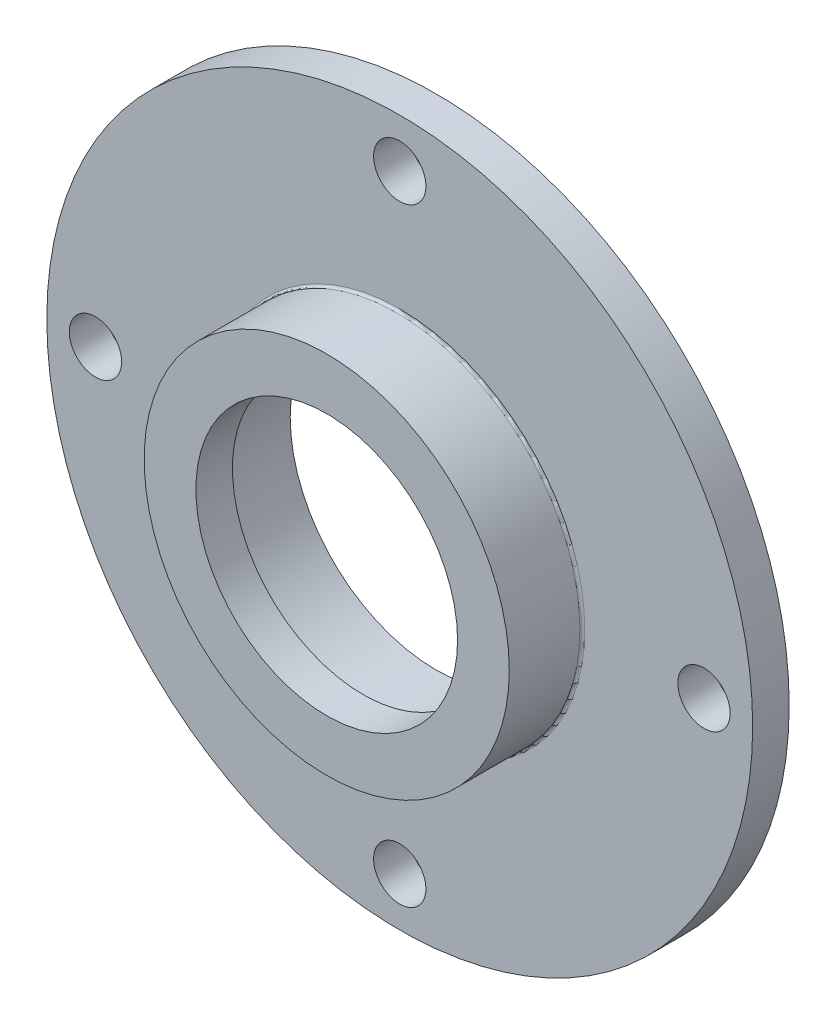
ISO-10303-21;
HEADER;
FILE_DESCRIPTION(('STEP AP214'),'2;1');
FILE_NAME('part.step','',(''),(''),'','','');
FILE_SCHEMA(('AUTOMOTIVE_DESIGN { 1 0 10303 214 1 1 1 1 }'));
ENDSEC;
DATA;
#1=APPLICATION_CONTEXT('core data for automotive mechanical design processes');
#2=APPLICATION_PROTOCOL_DEFINITION('international standard','automotive_design',2000,#1);
#3=PRODUCT_CONTEXT('',#1,'mechanical');
#4=PRODUCT('Part','Part','',(#3));
#5=PRODUCT_RELATED_PRODUCT_CATEGORY('part','',(#4));
#6=PRODUCT_DEFINITION_FORMATION('','',#4);
#7=PRODUCT_DEFINITION_CONTEXT('part definition',#1,'design');
#8=PRODUCT_DEFINITION('design','',#6,#7);
#9=PRODUCT_DEFINITION_SHAPE('','',#8);
#10=(LENGTH_UNIT() NAMED_UNIT(*) SI_UNIT(.MILLI.,.METRE.));
#11=(NAMED_UNIT(*) PLANE_ANGLE_UNIT() SI_UNIT($,.RADIAN.));
#12=(NAMED_UNIT(*) SI_UNIT($,.STERADIAN.) SOLID_ANGLE_UNIT());
#13=UNCERTAINTY_MEASURE_WITH_UNIT(LENGTH_MEASURE(1.E-05),#10,'distance_accuracy_value','');
#14=(GEOMETRIC_REPRESENTATION_CONTEXT(3) GLOBAL_UNCERTAINTY_ASSIGNED_CONTEXT((#13)) GLOBAL_UNIT_ASSIGNED_CONTEXT((#10,
#11,#12)) REPRESENTATION_CONTEXT('',''));
#15=CARTESIAN_POINT('',(0.,0.,0.));
#16=DIRECTION('',(0.,0.,1.));
#17=DIRECTION('',(1.,0.,0.));
#18=AXIS2_PLACEMENT_3D('',#15,#16,#17);
#19=CARTESIAN_POINT('',(0.,0.,3.));
#20=DIRECTION('',(0.,0.,-1.));
#21=DIRECTION('',(-1.,0.,0.));
#22=AXIS2_PLACEMENT_3D('',#19,#20,#21);
#23=CYLINDRICAL_SURFACE('',#22,12.);
#24=CARTESIAN_POINT('',(0.,0.,5.8));
#25=DIRECTION('',(0.,0.,1.));
#26=DIRECTION('',(1.,0.,0.));
#27=AXIS2_PLACEMENT_3D('',#24,#25,#26);
#28=CIRCLE('',#27,12.);
#29=CARTESIAN_POINT('',(12.,0.,5.8));
#30=VERTEX_POINT('',#29);
#31=EDGE_CURVE('E48',#30,#30,#28,.T.);
#32=ORIENTED_EDGE('',*,*,#31,.T.);
#33=EDGE_LOOP('',(#32));
#34=FACE_BOUND('',#33,.T.);
#35=CARTESIAN_POINT('',(0.,0.,0.));
#36=DIRECTION('',(0.,0.,1.));
#37=DIRECTION('',(1.,0.,0.));
#38=AXIS2_PLACEMENT_3D('',#35,#36,#37);
#39=CIRCLE('',#38,12.);
#40=CARTESIAN_POINT('',(12.,0.,0.));
#41=VERTEX_POINT('',#40);
#42=EDGE_CURVE('E57',#41,#41,#39,.T.);
#43=ORIENTED_EDGE('',*,*,#42,.F.);
#44=EDGE_LOOP('',(#43));
#45=FACE_BOUND('',#44,.T.);
#46=ADVANCED_FACE('F33',(#34,#45),#23,.F.);
#47=CARTESIAN_POINT('',(0.,0.,3.));
#48=DIRECTION('',(0.,0.,1.));
#49=DIRECTION('',(1.,0.,0.));
#50=AXIS2_PLACEMENT_3D('',#47,#48,#49);
#51=PLANE('',#50);
#52=CARTESIAN_POINT('',(0.,0.,3.));
#53=DIRECTION('',(0.,0.,1.));
#54=DIRECTION('',(1.,0.,0.));
#55=AXIS2_PLACEMENT_3D('',#52,#53,#54);
#56=CIRCLE('',#55,15.2);
#57=CARTESIAN_POINT('',(15.2,0.,3.));
#58=VERTEX_POINT('',#57);
#59=EDGE_CURVE('E10',#58,#58,#56,.F.);
#60=ORIENTED_EDGE('',*,*,#59,.T.);
#61=EDGE_LOOP('',(#60));
#62=FACE_BOUND('',#61,.T.);
#63=CARTESIAN_POINT('',(0.,25.,3.));
#64=DIRECTION('',(0.,0.,1.));
#65=DIRECTION('',(1.,0.,0.));
#66=AXIS2_PLACEMENT_3D('',#63,#64,#65);
#67=CIRCLE('',#66,2.15);
#68=CARTESIAN_POINT('',(2.15,25.,3.));
#69=VERTEX_POINT('',#68);
#70=EDGE_CURVE('E92',#69,#69,#67,.T.);
#71=ORIENTED_EDGE('',*,*,#70,.F.);
#72=EDGE_LOOP('',(#71));
#73=FACE_BOUND('',#72,.T.);
#74=CARTESIAN_POINT('',(25.0000000000006,5.52172050504306E-13,3.));
#75=DIRECTION('',(0.,0.,1.));
#76=DIRECTION('',(1.,0.,0.));
#77=AXIS2_PLACEMENT_3D('',#74,#75,#76);
#78=CIRCLE('',#77,2.15);
#79=CARTESIAN_POINT('',(27.1500000000006,5.52172050504306E-13,3.));
#80=VERTEX_POINT('',#79);
#81=EDGE_CURVE('E86',#80,#80,#78,.T.);
#82=ORIENTED_EDGE('',*,*,#81,.F.);
#83=EDGE_LOOP('',(#82));
#84=FACE_BOUND('',#83,.T.);
#85=CARTESIAN_POINT('',(1.10434410100861E-12,-25.,3.));
#86=DIRECTION('',(0.,0.,1.));
#87=DIRECTION('',(1.,0.,0.));
#88=AXIS2_PLACEMENT_3D('',#85,#86,#87);
#89=CIRCLE('',#88,2.15);
#90=CARTESIAN_POINT('',(2.1500000000011,-25.,3.));
#91=VERTEX_POINT('',#90);
#92=EDGE_CURVE('E80',#91,#91,#89,.T.);
#93=ORIENTED_EDGE('',*,*,#92,.F.);
#94=EDGE_LOOP('',(#93));
#95=FACE_BOUND('',#94,.T.);
#96=CARTESIAN_POINT('',(-24.9999999999995,-5.49110433506438E-13,3.));
#97=DIRECTION('',(0.,0.,1.));
#98=DIRECTION('',(1.,0.,0.));
#99=AXIS2_PLACEMENT_3D('',#96,#97,#98);
#100=CIRCLE('',#99,2.15);
#101=CARTESIAN_POINT('',(-22.8499999999995,-5.49110433506438E-13,3.));
#102=VERTEX_POINT('',#101);
#103=EDGE_CURVE('E74',#102,#102,#100,.T.);
#104=ORIENTED_EDGE('',*,*,#103,.F.);
#105=EDGE_LOOP('',(#104));
#106=FACE_BOUND('',#105,.T.);
#107=CARTESIAN_POINT('',(0.,0.,3.));
#108=DIRECTION('',(0.,0.,1.));
#109=DIRECTION('',(1.,0.,0.));
#110=AXIS2_PLACEMENT_3D('',#107,#108,#109);
#111=CIRCLE('',#110,29.);
#112=CARTESIAN_POINT('',(29.,0.,3.));
#113=VERTEX_POINT('',#112);
#114=EDGE_CURVE('E53',#113,#113,#111,.T.);
#115=ORIENTED_EDGE('',*,*,#114,.T.);
#116=EDGE_LOOP('',(#115));
#117=FACE_BOUND('',#116,.T.);
#118=ADVANCED_FACE('F98',(#62,#73,#84,#95,#106,#117),#51,.T.);
#119=CARTESIAN_POINT('',(0.,0.,0.));
#120=DIRECTION('',(0.,0.,1.));
#121=DIRECTION('',(1.,0.,0.));
#122=AXIS2_PLACEMENT_3D('',#119,#120,#121);
#123=PLANE('',#122);
#124=CARTESIAN_POINT('',(0.,25.,0.));
#125=DIRECTION('',(0.,0.,1.));
#126=DIRECTION('',(1.,0.,0.));
#127=AXIS2_PLACEMENT_3D('',#124,#125,#126);
#128=CIRCLE('',#127,2.15);
#129=CARTESIAN_POINT('',(2.15,25.,0.));
#130=VERTEX_POINT('',#129);
#131=EDGE_CURVE('E89',#130,#130,#128,.T.);
#132=ORIENTED_EDGE('',*,*,#131,.T.);
#133=EDGE_LOOP('',(#132));
#134=FACE_BOUND('',#133,.T.);
#135=CARTESIAN_POINT('',(25.0000000000006,5.52172050504306E-13,0.));
#136=DIRECTION('',(0.,0.,1.));
#137=DIRECTION('',(1.,0.,0.));
#138=AXIS2_PLACEMENT_3D('',#135,#136,#137);
#139=CIRCLE('',#138,2.15);
#140=CARTESIAN_POINT('',(27.1500000000006,5.52172050504306E-13,0.));
#141=VERTEX_POINT('',#140);
#142=EDGE_CURVE('E83',#141,#141,#139,.T.);
#143=ORIENTED_EDGE('',*,*,#142,.T.);
#144=EDGE_LOOP('',(#143));
#145=FACE_BOUND('',#144,.T.);
#146=CARTESIAN_POINT('',(1.10434410100861E-12,-25.,0.));
#147=DIRECTION('',(0.,0.,1.));
#148=DIRECTION('',(1.,0.,0.));
#149=AXIS2_PLACEMENT_3D('',#146,#147,#148);
#150=CIRCLE('',#149,2.15);
#151=CARTESIAN_POINT('',(2.1500000000011,-25.,0.));
#152=VERTEX_POINT('',#151);
#153=EDGE_CURVE('E77',#152,#152,#150,.T.);
#154=ORIENTED_EDGE('',*,*,#153,.T.);
#155=EDGE_LOOP('',(#154));
#156=FACE_BOUND('',#155,.T.);
#157=CARTESIAN_POINT('',(-24.9999999999995,-5.49110433506438E-13,0.));
#158=DIRECTION('',(0.,0.,1.));
#159=DIRECTION('',(1.,0.,0.));
#160=AXIS2_PLACEMENT_3D('',#157,#158,#159);
#161=CIRCLE('',#160,2.15);
#162=CARTESIAN_POINT('',(-22.8499999999995,-5.49110433506438E-13,0.));
#163=VERTEX_POINT('',#162);
#164=EDGE_CURVE('E69',#163,#163,#161,.T.);
#165=ORIENTED_EDGE('',*,*,#164,.T.);
#166=EDGE_LOOP('',(#165));
#167=FACE_BOUND('',#166,.T.);
#168=CARTESIAN_POINT('',(0.,0.,0.));
#169=DIRECTION('',(0.,0.,1.));
#170=DIRECTION('',(1.,0.,0.));
#171=AXIS2_PLACEMENT_3D('',#168,#169,#170);
#172=CIRCLE('',#171,29.);
#173=CARTESIAN_POINT('',(29.,0.,0.));
#174=VERTEX_POINT('',#173);
#175=EDGE_CURVE('E54',#174,#174,#172,.T.);
#176=ORIENTED_EDGE('',*,*,#175,.F.);
#177=EDGE_LOOP('',(#176));
#178=FACE_BOUND('',#177,.T.);
#179=ORIENTED_EDGE('',*,*,#42,.T.);
#180=EDGE_LOOP('',(#179));
#181=FACE_BOUND('',#180,.T.);
#182=ADVANCED_FACE('F101',(#134,#145,#156,#167,#178,#181),#123,.F.);
#183=CARTESIAN_POINT('',(0.,0.,3.));
#184=DIRECTION('',(0.,0.,-1.));
#185=DIRECTION('',(-1.,0.,0.));
#186=AXIS2_PLACEMENT_3D('',#183,#184,#185);
#187=CYLINDRICAL_SURFACE('',#186,29.);
#188=ORIENTED_EDGE('',*,*,#114,.F.);
#189=EDGE_LOOP('',(#188));
#190=FACE_BOUND('',#189,.T.);
#191=ORIENTED_EDGE('',*,*,#175,.T.);
#192=EDGE_LOOP('',(#191));
#193=FACE_BOUND('',#192,.T.);
#194=ADVANCED_FACE('F111',(#190,#193),#187,.T.);
#195=CARTESIAN_POINT('',(0.,0.,9.));
#196=DIRECTION('',(0.,0.,1.));
#197=DIRECTION('',(1.,0.,0.));
#198=AXIS2_PLACEMENT_3D('',#195,#196,#197);
#199=PLANE('',#198);
#200=CARTESIAN_POINT('',(0.,0.,9.));
#201=DIRECTION('',(0.,0.,1.));
#202=DIRECTION('',(1.,0.,0.));
#203=AXIS2_PLACEMENT_3D('',#200,#201,#202);
#204=CIRCLE('',#203,15.);
#205=CARTESIAN_POINT('',(15.,0.,9.));
#206=VERTEX_POINT('',#205);
#207=EDGE_CURVE('E62',#206,#206,#204,.T.);
#208=ORIENTED_EDGE('',*,*,#207,.T.);
#209=EDGE_LOOP('',(#208));
#210=FACE_BOUND('',#209,.T.);
#211=CARTESIAN_POINT('',(0.,0.,9.));
#212=DIRECTION('',(0.,0.,1.));
#213=DIRECTION('',(1.,0.,0.));
#214=AXIS2_PLACEMENT_3D('',#211,#212,#213);
#215=CIRCLE('',#214,10.75);
#216=CARTESIAN_POINT('',(10.75,0.,9.));
#217=VERTEX_POINT('',#216);
#218=EDGE_CURVE('E66',#217,#217,#215,.T.);
#219=ORIENTED_EDGE('',*,*,#218,.F.);
#220=EDGE_LOOP('',(#219));
#221=FACE_BOUND('',#220,.T.);
#222=ADVANCED_FACE('F114',(#210,#221),#199,.T.);
#223=CARTESIAN_POINT('',(0.,0.,9.));
#224=DIRECTION('',(0.,0.,-1.));
#225=DIRECTION('',(-1.,0.,0.));
#226=AXIS2_PLACEMENT_3D('',#223,#224,#225);
#227=CYLINDRICAL_SURFACE('',#226,15.);
#228=CARTESIAN_POINT('',(0.,0.,3.2));
#229=DIRECTION('',(0.,0.,1.));
#230=DIRECTION('',(1.,0.,0.));
#231=AXIS2_PLACEMENT_3D('',#228,#229,#230);
#232=CIRCLE('',#231,15.);
#233=CARTESIAN_POINT('',(15.,0.,3.2));
#234=VERTEX_POINT('',#233);
#235=EDGE_CURVE('E40',#234,#234,#232,.T.);
#236=ORIENTED_EDGE('',*,*,#235,.T.);
#237=EDGE_LOOP('',(#236));
#238=FACE_BOUND('',#237,.T.);
#239=ORIENTED_EDGE('',*,*,#207,.F.);
#240=EDGE_LOOP('',(#239));
#241=FACE_BOUND('',#240,.T.);
#242=ADVANCED_FACE('F130',(#238,#241),#227,.T.);
#243=CARTESIAN_POINT('',(0.,0.,6.));
#244=DIRECTION('',(0.,0.,1.));
#245=DIRECTION('',(1.,0.,0.));
#246=AXIS2_PLACEMENT_3D('',#243,#244,#245);
#247=PLANE('',#246);
#248=CARTESIAN_POINT('',(0.,0.,6.));
#249=DIRECTION('',(0.,0.,1.));
#250=DIRECTION('',(1.,0.,0.));
#251=AXIS2_PLACEMENT_3D('',#248,#249,#250);
#252=CIRCLE('',#251,11.8);
#253=CARTESIAN_POINT('',(11.8,0.,6.));
#254=VERTEX_POINT('',#253);
#255=EDGE_CURVE('E44',#254,#254,#252,.F.);
#256=ORIENTED_EDGE('',*,*,#255,.T.);
#257=EDGE_LOOP('',(#256));
#258=FACE_BOUND('',#257,.T.);
#259=CARTESIAN_POINT('',(0.,0.,6.));
#260=DIRECTION('',(0.,0.,1.));
#261=DIRECTION('',(1.,0.,0.));
#262=AXIS2_PLACEMENT_3D('',#259,#260,#261);
#263=CIRCLE('',#262,10.75);
#264=CARTESIAN_POINT('',(10.75,0.,6.));
#265=VERTEX_POINT('',#264);
#266=EDGE_CURVE('E65',#265,#265,#263,.T.);
#267=ORIENTED_EDGE('',*,*,#266,.T.);
#268=EDGE_LOOP('',(#267));
#269=FACE_BOUND('',#268,.T.);
#270=ADVANCED_FACE('F147',(#258,#269),#247,.F.);
#271=CARTESIAN_POINT('',(0.,0.,6.));
#272=DIRECTION('',(0.,0.,1.));
#273=DIRECTION('',(1.,0.,0.));
#274=AXIS2_PLACEMENT_3D('',#271,#272,#273);
#275=CYLINDRICAL_SURFACE('',#274,10.75);
#276=ORIENTED_EDGE('',*,*,#266,.F.);
#277=EDGE_LOOP('',(#276));
#278=FACE_BOUND('',#277,.T.);
#279=ORIENTED_EDGE('',*,*,#218,.T.);
#280=EDGE_LOOP('',(#279));
#281=FACE_BOUND('',#280,.T.);
#282=ADVANCED_FACE('F150',(#278,#281),#275,.F.);
#283=CARTESIAN_POINT('',(-24.9999999999995,-5.49110433506438E-13,3.));
#284=DIRECTION('',(0.,0.,1.));
#285=DIRECTION('',(1.,0.,0.));
#286=AXIS2_PLACEMENT_3D('',#283,#284,#285);
#287=CYLINDRICAL_SURFACE('',#286,2.15);
#288=ORIENTED_EDGE('',*,*,#164,.F.);
#289=EDGE_LOOP('',(#288));
#290=FACE_BOUND('',#289,.T.);
#291=ORIENTED_EDGE('',*,*,#103,.T.);
#292=EDGE_LOOP('',(#291));
#293=FACE_BOUND('',#292,.T.);
#294=ADVANCED_FACE('F156',(#290,#293),#287,.F.);
#295=CARTESIAN_POINT('',(1.10434410100861E-12,-25.,3.));
#296=DIRECTION('',(0.,0.,1.));
#297=DIRECTION('',(1.,0.,0.));
#298=AXIS2_PLACEMENT_3D('',#295,#296,#297);
#299=CYLINDRICAL_SURFACE('',#298,2.15);
#300=ORIENTED_EDGE('',*,*,#153,.F.);
#301=EDGE_LOOP('',(#300));
#302=FACE_BOUND('',#301,.T.);
#303=ORIENTED_EDGE('',*,*,#92,.T.);
#304=EDGE_LOOP('',(#303));
#305=FACE_BOUND('',#304,.T.);
#306=ADVANCED_FACE('F168',(#302,#305),#299,.F.);
#307=CARTESIAN_POINT('',(25.0000000000006,5.52172050504306E-13,3.));
#308=DIRECTION('',(0.,0.,1.));
#309=DIRECTION('',(1.,0.,0.));
#310=AXIS2_PLACEMENT_3D('',#307,#308,#309);
#311=CYLINDRICAL_SURFACE('',#310,2.15);
#312=ORIENTED_EDGE('',*,*,#142,.F.);
#313=EDGE_LOOP('',(#312));
#314=FACE_BOUND('',#313,.T.);
#315=ORIENTED_EDGE('',*,*,#81,.T.);
#316=EDGE_LOOP('',(#315));
#317=FACE_BOUND('',#316,.T.);
#318=ADVANCED_FACE('F140',(#314,#317),#311,.F.);
#319=CARTESIAN_POINT('',(0.,25.,3.));
#320=DIRECTION('',(0.,0.,1.));
#321=DIRECTION('',(1.,0.,0.));
#322=AXIS2_PLACEMENT_3D('',#319,#320,#321);
#323=CYLINDRICAL_SURFACE('',#322,2.15);
#324=ORIENTED_EDGE('',*,*,#131,.F.);
#325=EDGE_LOOP('',(#324));
#326=FACE_BOUND('',#325,.T.);
#327=ORIENTED_EDGE('',*,*,#70,.T.);
#328=EDGE_LOOP('',(#327));
#329=FACE_BOUND('',#328,.T.);
#330=ADVANCED_FACE('F96',(#326,#329),#323,.F.);
#331=CARTESIAN_POINT('',(0.,0.,5.8));
#332=DIRECTION('',(0.,0.,1.));
#333=DIRECTION('',(1.,0.,0.));
#334=AXIS2_PLACEMENT_3D('',#331,#332,#333);
#335=TOROIDAL_SURFACE('',#334,11.8,0.2);
#336=ORIENTED_EDGE('',*,*,#255,.F.);
#337=EDGE_LOOP('',(#336));
#338=FACE_BOUND('',#337,.T.);
#339=ORIENTED_EDGE('',*,*,#31,.F.);
#340=EDGE_LOOP('',(#339));
#341=FACE_BOUND('',#340,.T.);
#342=ADVANCED_FACE('F132',(#338,#341),#335,.F.);
#343=CARTESIAN_POINT('',(0.,0.,3.2));
#344=DIRECTION('',(0.,0.,1.));
#345=DIRECTION('',(1.,0.,0.));
#346=AXIS2_PLACEMENT_3D('',#343,#344,#345);
#347=TOROIDAL_SURFACE('',#346,15.2,0.2);
#348=ORIENTED_EDGE('',*,*,#59,.F.);
#349=EDGE_LOOP('',(#348));
#350=FACE_BOUND('',#349,.T.);
#351=ORIENTED_EDGE('',*,*,#235,.F.);
#352=EDGE_LOOP('',(#351));
#353=FACE_BOUND('',#352,.T.);
#354=ADVANCED_FACE('F35',(#350,#353),#347,.F.);
#355=CLOSED_SHELL('',(#46,#118,#182,#194,#222,#242,#270,#282,#294,#306,#318,#330,#342,#354));
#356=MANIFOLD_SOLID_BREP('B2',#355);
#357=ADVANCED_BREP_SHAPE_REPRESENTATION('',(#18,#356),#14);
#358=SHAPE_DEFINITION_REPRESENTATION(#9,#357);
ENDSEC;
END-ISO-10303-21;
